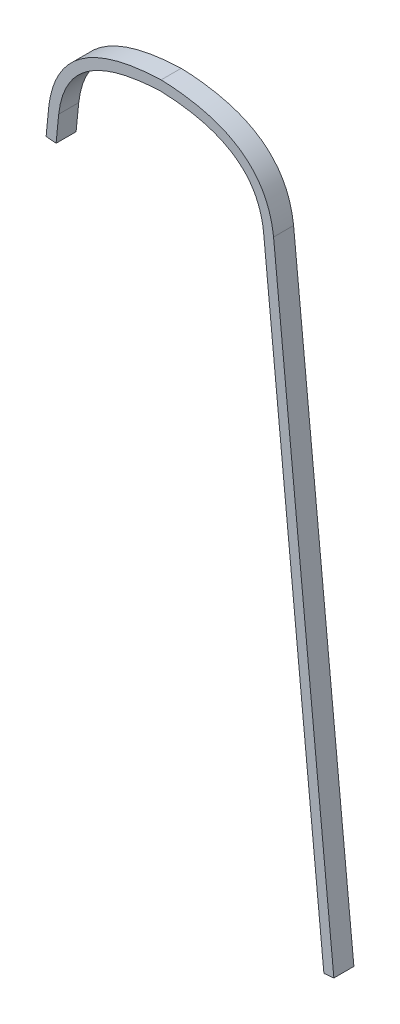
ISO-10303-21;
HEADER;
FILE_DESCRIPTION(('STEP AP214'),'2;1');
FILE_NAME('part.step','',(''),(''),'','','');
FILE_SCHEMA(('AUTOMOTIVE_DESIGN { 1 0 10303 214 1 1 1 1 }'));
ENDSEC;
DATA;
#1=APPLICATION_CONTEXT('core data for automotive mechanical design processes');
#2=APPLICATION_PROTOCOL_DEFINITION('international standard','automotive_design',2000,#1);
#3=PRODUCT_CONTEXT('',#1,'mechanical');
#4=PRODUCT('Part','Part','',(#3));
#5=PRODUCT_RELATED_PRODUCT_CATEGORY('part','',(#4));
#6=PRODUCT_DEFINITION_FORMATION('','',#4);
#7=PRODUCT_DEFINITION_CONTEXT('part definition',#1,'design');
#8=PRODUCT_DEFINITION('design','',#6,#7);
#9=PRODUCT_DEFINITION_SHAPE('','',#8);
#10=(LENGTH_UNIT() NAMED_UNIT(*) SI_UNIT(.MILLI.,.METRE.));
#11=(NAMED_UNIT(*) PLANE_ANGLE_UNIT() SI_UNIT($,.RADIAN.));
#12=(NAMED_UNIT(*) SI_UNIT($,.STERADIAN.) SOLID_ANGLE_UNIT());
#13=UNCERTAINTY_MEASURE_WITH_UNIT(LENGTH_MEASURE(1.E-05),#10,'distance_accuracy_value','');
#14=(GEOMETRIC_REPRESENTATION_CONTEXT(3) GLOBAL_UNCERTAINTY_ASSIGNED_CONTEXT((#13)) GLOBAL_UNIT_ASSIGNED_CONTEXT((#10,
#11,#12)) REPRESENTATION_CONTEXT('',''));
#15=CARTESIAN_POINT('',(0.,0.,0.));
#16=DIRECTION('',(0.,0.,1.));
#17=DIRECTION('',(1.,0.,0.));
#18=AXIS2_PLACEMENT_3D('',#15,#16,#17);
#19=CARTESIAN_POINT('',(106.876080835467,736.833680097404,19.05));
#20=CARTESIAN_POINT('',(98.6555645680486,809.385111394009,19.05));
#21=CARTESIAN_POINT('',(0.,812.8,19.05));
#22=B_SPLINE_CURVE_WITH_KNOTS('',2,(#19,#20,#21),.UNSPECIFIED.,.F.,.F.,(3,3),(0.,1.),.UNSPECIFIED.);
#23=DIRECTION('',(0.,0.,-1.));
#24=VECTOR('',#23,1.);
#25=SURFACE_OF_LINEAR_EXTRUSION('',#22,#24);
#26=CARTESIAN_POINT('',(106.876080835467,736.833680097404,0.));
#27=CARTESIAN_POINT('',(98.6555645680486,809.385111394009,0.));
#28=CARTESIAN_POINT('',(0.,812.8,0.));
#29=B_SPLINE_CURVE_WITH_KNOTS('',2,(#26,#27,#28),.UNSPECIFIED.,.F.,.F.,(3,3),(0.,1.),.UNSPECIFIED.);
#30=CARTESIAN_POINT('',(106.876080835467,736.833680097404,0.));
#31=VERTEX_POINT('',#30);
#32=CARTESIAN_POINT('',(0.,812.8,0.));
#33=VERTEX_POINT('',#32);
#34=EDGE_CURVE('E142',#31,#33,#29,.T.);
#35=ORIENTED_EDGE('',*,*,#34,.T.);
#36=DIRECTION('',(0.,0.,-1.));
#37=VECTOR('',#36,1.);
#38=CARTESIAN_POINT('',(0.,812.8,19.05));
#39=LINE('',#38,#37);
#40=CARTESIAN_POINT('',(0.,812.8,19.05));
#41=VERTEX_POINT('',#40);
#42=EDGE_CURVE('E11',#41,#33,#39,.T.);
#43=ORIENTED_EDGE('',*,*,#42,.F.);
#44=CARTESIAN_POINT('',(106.876080835467,736.833680097404,19.05));
#45=VERTEX_POINT('',#44);
#46=EDGE_CURVE('E180',#45,#41,#22,.T.);
#47=ORIENTED_EDGE('',*,*,#46,.F.);
#48=DIRECTION('',(0.,0.,-1.));
#49=VECTOR('',#48,1.);
#50=CARTESIAN_POINT('',(106.876080835467,736.833680097404,19.05));
#51=LINE('',#50,#49);
#52=EDGE_CURVE('E138',#45,#31,#51,.T.);
#53=ORIENTED_EDGE('',*,*,#52,.T.);
#54=EDGE_LOOP('',(#35,#43,#47,#53));
#55=FACE_BOUND('',#54,.T.);
#56=ADVANCED_FACE('F33',(#55),#25,.F.);
#57=CARTESIAN_POINT('',(0.,812.8,19.05));
#58=CARTESIAN_POINT('',(-98.6555645680486,809.385111394009,19.05));
#59=CARTESIAN_POINT('',(-106.876080835467,736.833680097404,19.05));
#60=B_SPLINE_CURVE_WITH_KNOTS('',2,(#57,#58,#59),.UNSPECIFIED.,.F.,.F.,(3,3),(0.,1.),.UNSPECIFIED.);
#61=DIRECTION('',(0.,0.,-1.));
#62=VECTOR('',#61,1.);
#63=SURFACE_OF_LINEAR_EXTRUSION('',#60,#62);
#64=CARTESIAN_POINT('',(0.,812.8,0.));
#65=CARTESIAN_POINT('',(-98.6555645680486,809.385111394009,0.));
#66=CARTESIAN_POINT('',(-106.876080835467,736.833680097404,0.));
#67=B_SPLINE_CURVE_WITH_KNOTS('',2,(#64,#65,#66),.UNSPECIFIED.,.F.,.F.,(3,3),(0.,1.),.UNSPECIFIED.);
#68=CARTESIAN_POINT('',(-106.876080835467,736.833680097404,0.));
#69=VERTEX_POINT('',#68);
#70=EDGE_CURVE('E147',#33,#69,#67,.T.);
#71=ORIENTED_EDGE('',*,*,#70,.T.);
#72=DIRECTION('',(0.,0.,-1.));
#73=VECTOR('',#72,1.);
#74=CARTESIAN_POINT('',(-106.876080835467,736.833680097404,19.05));
#75=LINE('',#74,#73);
#76=CARTESIAN_POINT('',(-106.876080835467,736.833680097404,19.05));
#77=VERTEX_POINT('',#76);
#78=EDGE_CURVE('E42',#77,#69,#75,.T.);
#79=ORIENTED_EDGE('',*,*,#78,.F.);
#80=EDGE_CURVE('E99',#41,#77,#60,.T.);
#81=ORIENTED_EDGE('',*,*,#80,.F.);
#82=ORIENTED_EDGE('',*,*,#42,.T.);
#83=EDGE_LOOP('',(#71,#79,#81,#82));
#84=FACE_BOUND('',#83,.T.);
#85=ADVANCED_FACE('F246',(#84),#63,.F.);
#86=CARTESIAN_POINT('',(-109.368223300656,711.556235093346,19.05));
#87=DIRECTION('',(0.995175000159784,-0.0981158450861764,0.));
#88=DIRECTION('',(0.0981158450861764,0.995175000159784,0.));
#89=AXIS2_PLACEMENT_3D('',#86,#87,#88);
#90=PLANE('',#89);
#91=DIRECTION('',(-0.0981158450861764,-0.995175000159784,0.));
#92=VECTOR('',#91,1.);
#93=CARTESIAN_POINT('',(-109.368223300656,711.556235093346,0.));
#94=LINE('',#93,#92);
#95=CARTESIAN_POINT('',(-109.368223300656,711.556235093346,0.));
#96=VERTEX_POINT('',#95);
#97=EDGE_CURVE('E154',#69,#96,#94,.T.);
#98=ORIENTED_EDGE('',*,*,#97,.T.);
#99=DIRECTION('',(0.,0.,-1.));
#100=VECTOR('',#99,1.);
#101=CARTESIAN_POINT('',(-109.368223300656,711.556235093346,19.05));
#102=LINE('',#101,#100);
#103=CARTESIAN_POINT('',(-109.368223300656,711.556235093346,19.05));
#104=VERTEX_POINT('',#103);
#105=EDGE_CURVE('E193',#104,#96,#102,.T.);
#106=ORIENTED_EDGE('',*,*,#105,.F.);
#107=DIRECTION('',(-0.0981158450861764,-0.995175000159784,0.));
#108=VECTOR('',#107,1.);
#109=CARTESIAN_POINT('',(-109.368223300656,711.556235093346,19.05));
#110=LINE('',#109,#108);
#111=EDGE_CURVE('E201',#77,#104,#110,.T.);
#112=ORIENTED_EDGE('',*,*,#111,.F.);
#113=ORIENTED_EDGE('',*,*,#78,.T.);
#114=EDGE_LOOP('',(#98,#106,#112,#113));
#115=FACE_BOUND('',#114,.T.);
#116=ADVANCED_FACE('F199',(#115),#90,.F.);
#117=CARTESIAN_POINT('',(-109.368223300656,711.556235093346,19.05));
#118=DIRECTION('',(0.0981158450861748,0.995175000159784,0.));
#119=DIRECTION('',(-0.995175000159784,0.0981158450861748,0.));
#120=AXIS2_PLACEMENT_3D('',#117,#118,#119);
#121=PLANE('',#120);
#122=DIRECTION('',(0.995175000159784,-0.0981158450861748,0.));
#123=VECTOR('',#122,1.);
#124=CARTESIAN_POINT('',(-109.368223300656,711.556235093346,0.));
#125=LINE('',#124,#123);
#126=CARTESIAN_POINT('',(-99.8891814241341,710.6216816689,0.));
#127=VERTEX_POINT('',#126);
#128=EDGE_CURVE('E159',#96,#127,#125,.T.);
#129=ORIENTED_EDGE('',*,*,#128,.T.);
#130=DIRECTION('',(0.,0.,-1.));
#131=VECTOR('',#130,1.);
#132=CARTESIAN_POINT('',(-99.8891814241341,710.6216816689,19.05));
#133=LINE('',#132,#131);
#134=CARTESIAN_POINT('',(-99.8891814241341,710.6216816689,19.05));
#135=VERTEX_POINT('',#134);
#136=EDGE_CURVE('E190',#135,#127,#133,.T.);
#137=ORIENTED_EDGE('',*,*,#136,.F.);
#138=DIRECTION('',(0.995175000159784,-0.0981158450861748,0.));
#139=VECTOR('',#138,1.);
#140=CARTESIAN_POINT('',(-109.368223300656,711.556235093346,19.05));
#141=LINE('',#140,#139);
#142=EDGE_CURVE('E219',#104,#135,#141,.T.);
#143=ORIENTED_EDGE('',*,*,#142,.F.);
#144=ORIENTED_EDGE('',*,*,#105,.T.);
#145=EDGE_LOOP('',(#129,#137,#143,#144));
#146=FACE_BOUND('',#145,.T.);
#147=ADVANCED_FACE('F210',(#146),#121,.F.);
#148=CARTESIAN_POINT('',(-99.8891814241341,710.6216816689,19.05));
#149=DIRECTION('',(-0.995175000159784,0.0981158450861764,0.));
#150=DIRECTION('',(-0.0981158450861764,-0.995175000159784,0.));
#151=AXIS2_PLACEMENT_3D('',#148,#149,#150);
#152=PLANE('',#151);
#153=DIRECTION('',(0.0981158450861764,0.995175000159784,0.));
#154=VECTOR('',#153,1.);
#155=CARTESIAN_POINT('',(-99.8891814241341,710.6216816689,0.));
#156=LINE('',#155,#154);
#157=CARTESIAN_POINT('',(-97.4039935722559,735.828587023664,0.));
#158=VERTEX_POINT('',#157);
#159=EDGE_CURVE('E161',#127,#158,#156,.T.);
#160=ORIENTED_EDGE('',*,*,#159,.T.);
#161=DIRECTION('',(0.,0.,-1.));
#162=VECTOR('',#161,1.);
#163=CARTESIAN_POINT('',(-97.4039935722559,735.828587023664,19.05));
#164=LINE('',#163,#162);
#165=CARTESIAN_POINT('',(-97.4039935722559,735.828587023664,19.05));
#166=VERTEX_POINT('',#165);
#167=EDGE_CURVE('E187',#166,#158,#164,.T.);
#168=ORIENTED_EDGE('',*,*,#167,.F.);
#169=DIRECTION('',(0.0981158450861764,0.995175000159784,0.));
#170=VECTOR('',#169,1.);
#171=CARTESIAN_POINT('',(-99.8891814241341,710.6216816689,19.05));
#172=LINE('',#171,#170);
#173=EDGE_CURVE('E216',#135,#166,#172,.T.);
#174=ORIENTED_EDGE('',*,*,#173,.F.);
#175=ORIENTED_EDGE('',*,*,#136,.T.);
#176=EDGE_LOOP('',(#160,#168,#174,#175));
#177=FACE_BOUND('',#176,.T.);
#178=ADVANCED_FACE('F214',(#177),#152,.F.);
#179=CARTESIAN_POINT('',(-97.4039935722559,735.828587023664,19.05));
#180=CARTESIAN_POINT('',(-97.3262059512527,736.510966359992,19.05));
#181=CARTESIAN_POINT('',(-97.1553796672026,737.881968464566,19.05));
#182=CARTESIAN_POINT('',(-96.7640206157546,740.553537606217,19.05));
#183=CARTESIAN_POINT('',(-96.1773627381838,743.805316844235,19.05));
#184=CARTESIAN_POINT('',(-95.3214140006328,747.554999290887,19.05));
#185=CARTESIAN_POINT('',(-93.9799340011733,752.359286406523,19.05));
#186=CARTESIAN_POINT('',(-91.9331304846631,758.003164249533,19.05));
#187=CARTESIAN_POINT('',(-88.8952522600479,764.228265264046,19.05));
#188=CARTESIAN_POINT('',(-85.2743135617021,769.943199813082,19.05));
#189=CARTESIAN_POINT('',(-79.6482414168434,776.932392043286,19.05));
#190=CARTESIAN_POINT('',(-71.0507907120011,784.572420077556,19.05));
#191=CARTESIAN_POINT('',(-60.1294569627941,790.832450745801,19.05));
#192=CARTESIAN_POINT('',(-49.8978420395012,794.967332344283,19.05));
#193=CARTESIAN_POINT('',(-41.4669949701447,797.61410959326,19.05));
#194=CARTESIAN_POINT('',(-32.2731280075781,799.79005238411,19.05));
#195=CARTESIAN_POINT('',(-23.975792062962,801.1984248908,19.05));
#196=CARTESIAN_POINT('',(-16.9573043317647,802.075979485788,19.05));
#197=CARTESIAN_POINT('',(-11.5049121120335,802.608232021652,19.05));
#198=CARTESIAN_POINT('',(-6.80036284859527,802.946009067599,19.05));
#199=CARTESIAN_POINT('',(-2.95007512349235,803.15190905775,19.05));
#200=CARTESIAN_POINT('',(-0.979817657945946,803.233925105122,19.05));
#201=CARTESIAN_POINT('',(4.83771009363032E-13,803.269086279872,19.05));
#202=B_SPLINE_CURVE_WITH_KNOTS('',3,(#179,#180,#181,#182,#183,#184,#185,#186,#187,#188,#189,
#190,#191,#192,#193,#194,#195,#196,#197,#198,#199,#200,#201),.UNSPECIFIED.,.F.,.F.,(4,1,1,1,1,1,
1,1,1,1,1,1,1,1,1,1,1,1,1,1,4),(0.00050817300302827,0.0160981610016207,0.0316881490002131,
0.0628681249973979,0.0940481009945827,0.125228076991767,0.187588028986137,0.249947980980507,
0.312307932974876,0.374667884969246,0.499387788957985,0.624107692946725,0.686467644941094,
0.748827596935464,0.811187548929833,0.873547500924203,0.904727476921388,0.935907452918573,
0.967087428915757,0.98267741691435,0.998267404912942),.UNSPECIFIED.);
#203=DIRECTION('',(0.,0.,-1.));
#204=VECTOR('',#203,1.);
#205=SURFACE_OF_LINEAR_EXTRUSION('',#202,#204);
#206=CARTESIAN_POINT('',(-97.4039935722559,735.828587023664,0.));
#207=CARTESIAN_POINT('',(-97.3262059512527,736.510966359992,0.));
#208=CARTESIAN_POINT('',(-97.1553796672026,737.881968464566,0.));
#209=CARTESIAN_POINT('',(-96.7640206157546,740.553537606217,0.));
#210=CARTESIAN_POINT('',(-96.1773627381838,743.805316844235,0.));
#211=CARTESIAN_POINT('',(-95.3214140006328,747.554999290887,0.));
#212=CARTESIAN_POINT('',(-93.9799340011733,752.359286406523,0.));
#213=CARTESIAN_POINT('',(-91.9331304846631,758.003164249533,0.));
#214=CARTESIAN_POINT('',(-88.8952522600479,764.228265264046,0.));
#215=CARTESIAN_POINT('',(-85.2743135617021,769.943199813082,0.));
#216=CARTESIAN_POINT('',(-79.6482414168434,776.932392043286,0.));
#217=CARTESIAN_POINT('',(-71.0507907120011,784.572420077556,0.));
#218=CARTESIAN_POINT('',(-60.1294569627941,790.832450745801,0.));
#219=CARTESIAN_POINT('',(-49.8978420395012,794.967332344283,0.));
#220=CARTESIAN_POINT('',(-41.4669949701447,797.61410959326,0.));
#221=CARTESIAN_POINT('',(-32.2731280075781,799.79005238411,0.));
#222=CARTESIAN_POINT('',(-23.975792062962,801.1984248908,0.));
#223=CARTESIAN_POINT('',(-16.9573043317647,802.075979485788,0.));
#224=CARTESIAN_POINT('',(-11.5049121120335,802.608232021652,0.));
#225=CARTESIAN_POINT('',(-6.80036284859527,802.946009067599,0.));
#226=CARTESIAN_POINT('',(-2.95007512349235,803.15190905775,0.));
#227=CARTESIAN_POINT('',(-0.979817657945946,803.233925105122,0.));
#228=CARTESIAN_POINT('',(4.83771009363032E-13,803.269086279872,0.));
#229=B_SPLINE_CURVE_WITH_KNOTS('',3,(#206,#207,#208,#209,#210,#211,#212,#213,#214,#215,#216,
#217,#218,#219,#220,#221,#222,#223,#224,#225,#226,#227,#228),.UNSPECIFIED.,.F.,.F.,(4,1,1,1,1,1,
1,1,1,1,1,1,1,1,1,1,1,1,1,1,4),(0.00050817300302827,0.0160981610016207,0.0316881490002131,
0.0628681249973979,0.0940481009945827,0.125228076991767,0.187588028986137,0.249947980980507,
0.312307932974876,0.374667884969246,0.499387788957985,0.624107692946725,0.686467644941094,
0.748827596935464,0.811187548929833,0.873547500924203,0.904727476921388,0.935907452918573,
0.967087428915757,0.98267741691435,0.998267404912942),.UNSPECIFIED.);
#230=CARTESIAN_POINT('',(4.83771009363032E-13,803.269086279872,0.));
#231=VERTEX_POINT('',#230);
#232=EDGE_CURVE('E163',#158,#231,#229,.T.);
#233=ORIENTED_EDGE('',*,*,#232,.T.);
#234=DIRECTION('',(0.,0.,-1.));
#235=VECTOR('',#234,1.);
#236=CARTESIAN_POINT('',(4.83771009363032E-13,803.269086279872,19.05));
#237=LINE('',#236,#235);
#238=CARTESIAN_POINT('',(4.83771009363032E-13,803.269086279872,19.05));
#239=VERTEX_POINT('',#238);
#240=EDGE_CURVE('E184',#239,#231,#237,.T.);
#241=ORIENTED_EDGE('',*,*,#240,.F.);
#242=EDGE_CURVE('E218',#166,#239,#202,.T.);
#243=ORIENTED_EDGE('',*,*,#242,.F.);
#244=ORIENTED_EDGE('',*,*,#167,.T.);
#245=EDGE_LOOP('',(#233,#241,#243,#244));
#246=FACE_BOUND('',#245,.T.);
#247=ADVANCED_FACE('F234',(#246),#205,.F.);
#248=CARTESIAN_POINT('',(-4.7309161796405E-13,803.269086279872,19.05));
#249=CARTESIAN_POINT('',(0.979817657946005,803.233925105122,19.05));
#250=CARTESIAN_POINT('',(2.95007512349249,803.15190905775,19.05));
#251=CARTESIAN_POINT('',(6.80036284859567,802.946009067599,19.05));
#252=CARTESIAN_POINT('',(11.5049121120341,802.608232021652,19.05));
#253=CARTESIAN_POINT('',(16.9573043317656,802.075979485788,19.05));
#254=CARTESIAN_POINT('',(23.9757920629632,801.198424890801,19.05));
#255=CARTESIAN_POINT('',(32.2731280075797,799.79005238411,19.05));
#256=CARTESIAN_POINT('',(41.4669949701467,797.61410959326,19.05));
#257=CARTESIAN_POINT('',(49.8978420395034,794.967332344282,19.05));
#258=CARTESIAN_POINT('',(60.1294569627966,790.8324507458,19.05));
#259=CARTESIAN_POINT('',(71.0507907120036,784.572420077554,19.05));
#260=CARTESIAN_POINT('',(79.648241416846,776.932392043284,19.05));
#261=CARTESIAN_POINT('',(85.2743135617045,769.943199813078,19.05));
#262=CARTESIAN_POINT('',(88.8952522600501,764.228265264043,19.05));
#263=CARTESIAN_POINT('',(91.9331304846649,758.003164249528,19.05));
#264=CARTESIAN_POINT('',(93.979934001175,752.359286406518,19.05));
#265=CARTESIAN_POINT('',(95.3214140006343,747.554999290881,19.05));
#266=CARTESIAN_POINT('',(96.1773627381851,743.805316844229,19.05));
#267=CARTESIAN_POINT('',(96.7640206157557,740.553537606211,19.05));
#268=CARTESIAN_POINT('',(97.1553796672036,737.88196846456,19.05));
#269=CARTESIAN_POINT('',(97.3262059512535,736.510966359985,19.05));
#270=CARTESIAN_POINT('',(97.4039935722567,735.828587023657,19.05));
#271=B_SPLINE_CURVE_WITH_KNOTS('',3,(#248,#249,#250,#251,#252,#253,#254,#255,#256,#257,#258,
#259,#260,#261,#262,#263,#264,#265,#266,#267,#268,#269,#270),.UNSPECIFIED.,.F.,.F.,(4,1,1,1,1,1,
1,1,1,1,1,1,1,1,1,1,1,1,1,1,4),(0.000508173002974233,0.0160981610015676,0.0316881490001608,
0.0628681249973473,0.0940481009945338,0.12522807699172,0.187588028986093,0.249947980980466,
0.312307932974839,0.374667884969212,0.499387788957958,0.624107692946704,0.686467644941077,
0.74882759693545,0.811187548929823,0.873547500924196,0.904727476921383,0.935907452918569,
0.967087428915756,0.982677416914349,0.998267404912942),.UNSPECIFIED.);
#272=DIRECTION('',(0.,0.,-1.));
#273=VECTOR('',#272,1.);
#274=SURFACE_OF_LINEAR_EXTRUSION('',#271,#273);
#275=CARTESIAN_POINT('',(-4.7309161796405E-13,803.269086279872,0.));
#276=CARTESIAN_POINT('',(0.979817657946005,803.233925105122,0.));
#277=CARTESIAN_POINT('',(2.95007512349249,803.15190905775,0.));
#278=CARTESIAN_POINT('',(6.80036284859567,802.946009067599,0.));
#279=CARTESIAN_POINT('',(11.5049121120341,802.608232021652,0.));
#280=CARTESIAN_POINT('',(16.9573043317656,802.075979485788,0.));
#281=CARTESIAN_POINT('',(23.9757920629632,801.198424890801,0.));
#282=CARTESIAN_POINT('',(32.2731280075797,799.79005238411,0.));
#283=CARTESIAN_POINT('',(41.4669949701467,797.61410959326,0.));
#284=CARTESIAN_POINT('',(49.8978420395034,794.967332344282,0.));
#285=CARTESIAN_POINT('',(60.1294569627966,790.8324507458,0.));
#286=CARTESIAN_POINT('',(71.0507907120036,784.572420077554,0.));
#287=CARTESIAN_POINT('',(79.648241416846,776.932392043284,0.));
#288=CARTESIAN_POINT('',(85.2743135617045,769.943199813078,0.));
#289=CARTESIAN_POINT('',(88.8952522600501,764.228265264043,0.));
#290=CARTESIAN_POINT('',(91.9331304846649,758.003164249528,0.));
#291=CARTESIAN_POINT('',(93.979934001175,752.359286406518,0.));
#292=CARTESIAN_POINT('',(95.3214140006343,747.554999290881,0.));
#293=CARTESIAN_POINT('',(96.1773627381851,743.805316844229,0.));
#294=CARTESIAN_POINT('',(96.7640206157557,740.553537606211,0.));
#295=CARTESIAN_POINT('',(97.1553796672036,737.88196846456,0.));
#296=CARTESIAN_POINT('',(97.3262059512535,736.510966359985,0.));
#297=CARTESIAN_POINT('',(97.4039935722567,735.828587023657,0.));
#298=B_SPLINE_CURVE_WITH_KNOTS('',3,(#275,#276,#277,#278,#279,#280,#281,#282,#283,#284,#285,
#286,#287,#288,#289,#290,#291,#292,#293,#294,#295,#296,#297),.UNSPECIFIED.,.F.,.F.,(4,1,1,1,1,1,
1,1,1,1,1,1,1,1,1,1,1,1,1,1,4),(0.000508173002974233,0.0160981610015676,0.0316881490001608,
0.0628681249973473,0.0940481009945338,0.12522807699172,0.187588028986093,0.249947980980466,
0.312307932974839,0.374667884969212,0.499387788957958,0.624107692946704,0.686467644941077,
0.74882759693545,0.811187548929823,0.873547500924196,0.904727476921383,0.935907452918569,
0.967087428915756,0.982677416914349,0.998267404912942),.UNSPECIFIED.);
#299=CARTESIAN_POINT('',(97.4039935722567,735.828587023657,0.));
#300=VERTEX_POINT('',#299);
#301=EDGE_CURVE('E167',#231,#300,#298,.T.);
#302=ORIENTED_EDGE('',*,*,#301,.T.);
#303=DIRECTION('',(0.,0.,-1.));
#304=VECTOR('',#303,1.);
#305=CARTESIAN_POINT('',(97.4039935722567,735.828587023657,19.05));
#306=LINE('',#305,#304);
#307=CARTESIAN_POINT('',(97.4039935722567,735.828587023657,19.05));
#308=VERTEX_POINT('',#307);
#309=EDGE_CURVE('E133',#308,#300,#306,.T.);
#310=ORIENTED_EDGE('',*,*,#309,.F.);
#311=EDGE_CURVE('E124',#239,#308,#271,.T.);
#312=ORIENTED_EDGE('',*,*,#311,.F.);
#313=ORIENTED_EDGE('',*,*,#240,.T.);
#314=EDGE_LOOP('',(#302,#310,#312,#313));
#315=FACE_BOUND('',#314,.T.);
#316=ADVANCED_FACE('F238',(#315),#274,.F.);
#317=CARTESIAN_POINT('',(154.716315658705,154.517891579654,19.05));
#318=DIRECTION('',(0.995175000159714,0.0981158450868872,0.));
#319=DIRECTION('',(-0.0981158450868872,0.995175000159714,0.));
#320=AXIS2_PLACEMENT_3D('',#317,#318,#319);
#321=PLANE('',#320);
#322=DIRECTION('',(0.0981158450868872,-0.995175000159714,0.));
#323=VECTOR('',#322,1.);
#324=CARTESIAN_POINT('',(154.716315658705,154.517891579654,0.));
#325=LINE('',#324,#323);
#326=CARTESIAN_POINT('',(154.716315658705,154.517891579654,0.));
#327=VERTEX_POINT('',#326);
#328=EDGE_CURVE('E132',#300,#327,#325,.T.);
#329=ORIENTED_EDGE('',*,*,#328,.T.);
#330=DIRECTION('',(0.,0.,-1.));
#331=VECTOR('',#330,1.);
#332=CARTESIAN_POINT('',(154.716315658705,154.517891579654,19.05));
#333=LINE('',#332,#331);
#334=CARTESIAN_POINT('',(154.716315658705,154.517891579654,19.05));
#335=VERTEX_POINT('',#334);
#336=EDGE_CURVE('E129',#335,#327,#333,.T.);
#337=ORIENTED_EDGE('',*,*,#336,.F.);
#338=DIRECTION('',(0.0981158450868872,-0.995175000159714,0.));
#339=VECTOR('',#338,1.);
#340=CARTESIAN_POINT('',(154.716315658705,154.517891579654,19.05));
#341=LINE('',#340,#339);
#342=EDGE_CURVE('E118',#308,#335,#341,.T.);
#343=ORIENTED_EDGE('',*,*,#342,.F.);
#344=ORIENTED_EDGE('',*,*,#309,.T.);
#345=EDGE_LOOP('',(#329,#337,#343,#344));
#346=FACE_BOUND('',#345,.T.);
#347=ADVANCED_FACE('F130',(#346),#321,.F.);
#348=CARTESIAN_POINT('',(154.716315658705,154.517891579654,19.05));
#349=DIRECTION('',(-0.0981158450868834,0.995175000159714,0.));
#350=DIRECTION('',(-0.995175000159714,-0.0981158450868834,0.));
#351=AXIS2_PLACEMENT_3D('',#348,#349,#350);
#352=PLANE('',#351);
#353=DIRECTION('',(0.995175000159714,0.0981158450868834,0.));
#354=VECTOR('',#353,1.);
#355=CARTESIAN_POINT('',(154.716315658705,154.517891579654,0.));
#356=LINE('',#355,#354);
#357=CARTESIAN_POINT('',(164.195357535226,155.452445004106,0.));
#358=VERTEX_POINT('',#357);
#359=EDGE_CURVE('E85',#327,#358,#356,.T.);
#360=ORIENTED_EDGE('',*,*,#359,.T.);
#361=DIRECTION('',(0.,0.,-1.));
#362=VECTOR('',#361,1.);
#363=CARTESIAN_POINT('',(164.195357535226,155.452445004106,19.05));
#364=LINE('',#363,#362);
#365=CARTESIAN_POINT('',(164.195357535226,155.452445004106,19.05));
#366=VERTEX_POINT('',#365);
#367=EDGE_CURVE('E134',#366,#358,#364,.T.);
#368=ORIENTED_EDGE('',*,*,#367,.F.);
#369=DIRECTION('',(0.995175000159714,0.0981158450868834,0.));
#370=VECTOR('',#369,1.);
#371=CARTESIAN_POINT('',(154.716315658705,154.517891579654,19.05));
#372=LINE('',#371,#370);
#373=EDGE_CURVE('E122',#335,#366,#372,.T.);
#374=ORIENTED_EDGE('',*,*,#373,.F.);
#375=ORIENTED_EDGE('',*,*,#336,.T.);
#376=EDGE_LOOP('',(#360,#368,#374,#375));
#377=FACE_BOUND('',#376,.T.);
#378=ADVANCED_FACE('F136',(#377),#352,.F.);
#379=CARTESIAN_POINT('',(164.195357535226,155.452445004106,19.05));
#380=DIRECTION('',(-0.995175000159714,-0.0981158450868872,0.));
#381=DIRECTION('',(0.0981158450868872,-0.995175000159714,0.));
#382=AXIS2_PLACEMENT_3D('',#379,#380,#381);
#383=PLANE('',#382);
#384=DIRECTION('',(-0.0981158450868872,0.995175000159713,0.));
#385=VECTOR('',#384,1.);
#386=CARTESIAN_POINT('',(164.195357535226,155.452445004106,0.));
#387=LINE('',#386,#385);
#388=EDGE_CURVE('E91',#358,#31,#387,.T.);
#389=ORIENTED_EDGE('',*,*,#388,.T.);
#390=ORIENTED_EDGE('',*,*,#52,.F.);
#391=DIRECTION('',(-0.0981158450868872,0.995175000159713,0.));
#392=VECTOR('',#391,1.);
#393=CARTESIAN_POINT('',(164.195357535226,155.452445004106,19.05));
#394=LINE('',#393,#392);
#395=EDGE_CURVE('E50',#366,#45,#394,.T.);
#396=ORIENTED_EDGE('',*,*,#395,.F.);
#397=ORIENTED_EDGE('',*,*,#367,.T.);
#398=EDGE_LOOP('',(#389,#390,#396,#397));
#399=FACE_BOUND('',#398,.T.);
#400=ADVANCED_FACE('F310',(#399),#383,.F.);
#401=CARTESIAN_POINT('',(76.0468024928911,792.100975721355,19.05));
#402=DIRECTION('',(0.,0.,-1.));
#403=DIRECTION('',(-1.,0.,0.));
#404=AXIS2_PLACEMENT_3D('',#401,#402,#403);
#405=PLANE('',#404);
#406=ORIENTED_EDGE('',*,*,#46,.T.);
#407=ORIENTED_EDGE('',*,*,#80,.T.);
#408=ORIENTED_EDGE('',*,*,#111,.T.);
#409=ORIENTED_EDGE('',*,*,#142,.T.);
#410=ORIENTED_EDGE('',*,*,#173,.T.);
#411=ORIENTED_EDGE('',*,*,#242,.T.);
#412=ORIENTED_EDGE('',*,*,#311,.T.);
#413=ORIENTED_EDGE('',*,*,#342,.T.);
#414=ORIENTED_EDGE('',*,*,#373,.T.);
#415=ORIENTED_EDGE('',*,*,#395,.T.);
#416=EDGE_LOOP('',(#406,#407,#408,#409,#410,#411,#412,#413,#414,#415));
#417=FACE_BOUND('',#416,.T.);
#418=ADVANCED_FACE('F120',(#417),#405,.F.);
#419=CARTESIAN_POINT('',(76.0468024928911,792.100975721355,0.));
#420=DIRECTION('',(0.,0.,-1.));
#421=DIRECTION('',(-1.,0.,0.));
#422=AXIS2_PLACEMENT_3D('',#419,#420,#421);
#423=PLANE('',#422);
#424=ORIENTED_EDGE('',*,*,#34,.F.);
#425=ORIENTED_EDGE('',*,*,#388,.F.);
#426=ORIENTED_EDGE('',*,*,#359,.F.);
#427=ORIENTED_EDGE('',*,*,#328,.F.);
#428=ORIENTED_EDGE('',*,*,#301,.F.);
#429=ORIENTED_EDGE('',*,*,#232,.F.);
#430=ORIENTED_EDGE('',*,*,#159,.F.);
#431=ORIENTED_EDGE('',*,*,#128,.F.);
#432=ORIENTED_EDGE('',*,*,#97,.F.);
#433=ORIENTED_EDGE('',*,*,#70,.F.);
#434=EDGE_LOOP('',(#424,#425,#426,#427,#428,#429,#430,#431,#432,#433));
#435=FACE_BOUND('',#434,.T.);
#436=ADVANCED_FACE('F205',(#435),#423,.T.);
#437=CLOSED_SHELL('',(#56,#85,#116,#147,#178,#247,#316,#347,#378,#400,#418,#436));
#438=MANIFOLD_SOLID_BREP('B2',#437);
#439=ADVANCED_BREP_SHAPE_REPRESENTATION('',(#18,#438),#14);
#440=SHAPE_DEFINITION_REPRESENTATION(#9,#439);
ENDSEC;
END-ISO-10303-21;
